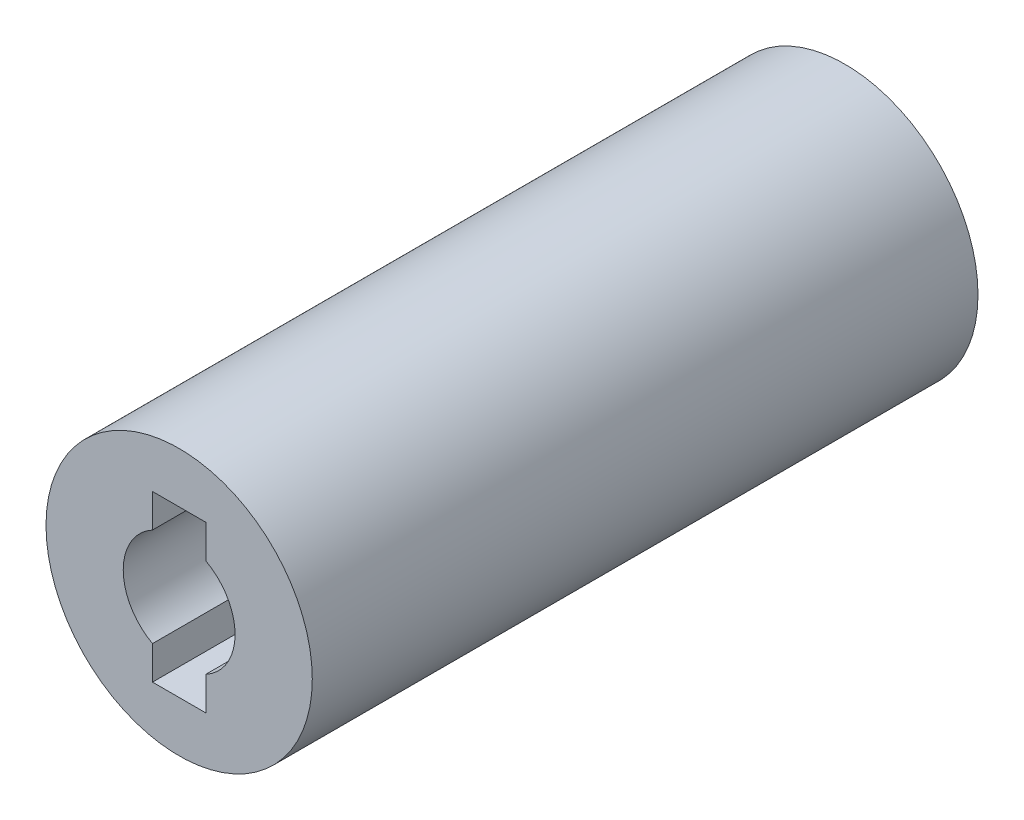
ISO-10303-21;
HEADER;
FILE_DESCRIPTION(('STEP AP214'),'2;1');
FILE_NAME('part.step','',(''),(''),'','','');
FILE_SCHEMA(('AUTOMOTIVE_DESIGN { 1 0 10303 214 1 1 1 1 }'));
ENDSEC;
DATA;
#1=APPLICATION_CONTEXT('core data for automotive mechanical design processes');
#2=APPLICATION_PROTOCOL_DEFINITION('international standard','automotive_design',2000,#1);
#3=PRODUCT_CONTEXT('',#1,'mechanical');
#4=PRODUCT('Part','Part','',(#3));
#5=PRODUCT_RELATED_PRODUCT_CATEGORY('part','',(#4));
#6=PRODUCT_DEFINITION_FORMATION('','',#4);
#7=PRODUCT_DEFINITION_CONTEXT('part definition',#1,'design');
#8=PRODUCT_DEFINITION('design','',#6,#7);
#9=PRODUCT_DEFINITION_SHAPE('','',#8);
#10=(LENGTH_UNIT() NAMED_UNIT(*) SI_UNIT(.MILLI.,.METRE.));
#11=(NAMED_UNIT(*) PLANE_ANGLE_UNIT() SI_UNIT($,.RADIAN.));
#12=(NAMED_UNIT(*) SI_UNIT($,.STERADIAN.) SOLID_ANGLE_UNIT());
#13=UNCERTAINTY_MEASURE_WITH_UNIT(LENGTH_MEASURE(1.E-05),#10,'distance_accuracy_value','');
#14=(GEOMETRIC_REPRESENTATION_CONTEXT(3) GLOBAL_UNCERTAINTY_ASSIGNED_CONTEXT((#13)) GLOBAL_UNIT_ASSIGNED_CONTEXT((#10,
#11,#12)) REPRESENTATION_CONTEXT('',''));
#15=CARTESIAN_POINT('',(0.,0.,0.));
#16=DIRECTION('',(0.,0.,1.));
#17=DIRECTION('',(1.,0.,0.));
#18=AXIS2_PLACEMENT_3D('',#15,#16,#17);
#19=CARTESIAN_POINT('',(0.,0.,15.));
#20=DIRECTION('',(0.,0.,1.));
#21=DIRECTION('',(1.,0.,0.));
#22=AXIS2_PLACEMENT_3D('',#19,#20,#21);
#23=CYLINDRICAL_SURFACE('',#22,2.1);
#24=CARTESIAN_POINT('',(0.,0.,25.));
#25=DIRECTION('',(0.,0.,1.));
#26=DIRECTION('',(1.,0.,0.));
#27=AXIS2_PLACEMENT_3D('',#24,#25,#26);
#28=CIRCLE('',#27,2.1);
#29=CARTESIAN_POINT('',(-1.,1.84661853126194,25.));
#30=VERTEX_POINT('',#29);
#31=CARTESIAN_POINT('',(-1.,-1.84661853126194,25.));
#32=VERTEX_POINT('',#31);
#33=EDGE_CURVE('E155',#30,#32,#28,.T.);
#34=ORIENTED_EDGE('',*,*,#33,.T.);
#35=DIRECTION('',(0.,0.,1.));
#36=VECTOR('',#35,1.);
#37=CARTESIAN_POINT('',(-1.,-1.84661853126194,15.));
#38=LINE('',#37,#36);
#39=CARTESIAN_POINT('',(-1.,-1.84661853126194,15.));
#40=VERTEX_POINT('',#39);
#41=EDGE_CURVE('E150',#32,#40,#38,.F.);
#42=ORIENTED_EDGE('',*,*,#41,.T.);
#43=CARTESIAN_POINT('',(0.,0.,15.));
#44=DIRECTION('',(0.,0.,1.));
#45=DIRECTION('',(1.,0.,0.));
#46=AXIS2_PLACEMENT_3D('',#43,#44,#45);
#47=CIRCLE('',#46,2.1);
#48=CARTESIAN_POINT('',(-1.,1.84661853126194,15.));
#49=VERTEX_POINT('',#48);
#50=EDGE_CURVE('E104',#49,#40,#47,.T.);
#51=ORIENTED_EDGE('',*,*,#50,.F.);
#52=DIRECTION('',(0.,0.,1.));
#53=VECTOR('',#52,1.);
#54=CARTESIAN_POINT('',(-1.,1.84661853126194,15.));
#55=LINE('',#54,#53);
#56=EDGE_CURVE('E147',#49,#30,#55,.T.);
#57=ORIENTED_EDGE('',*,*,#56,.T.);
#58=EDGE_LOOP('',(#34,#42,#51,#57));
#59=FACE_BOUND('',#58,.T.);
#60=ADVANCED_FACE('F33',(#59),#23,.F.);
#61=CARTESIAN_POINT('',(0.,0.,25.));
#62=DIRECTION('',(0.,0.,-1.));
#63=DIRECTION('',(-1.,0.,0.));
#64=AXIS2_PLACEMENT_3D('',#61,#62,#63);
#65=CYLINDRICAL_SURFACE('',#64,5.);
#66=CARTESIAN_POINT('',(0.,0.,25.));
#67=DIRECTION('',(0.,0.,1.));
#68=DIRECTION('',(1.,0.,0.));
#69=AXIS2_PLACEMENT_3D('',#66,#67,#68);
#70=CIRCLE('',#69,5.);
#71=CARTESIAN_POINT('',(5.,0.,25.));
#72=VERTEX_POINT('',#71);
#73=EDGE_CURVE('E11',#72,#72,#70,.T.);
#74=ORIENTED_EDGE('',*,*,#73,.F.);
#75=EDGE_LOOP('',(#74));
#76=FACE_BOUND('',#75,.T.);
#77=CARTESIAN_POINT('',(0.,0.,0.));
#78=DIRECTION('',(0.,0.,1.));
#79=DIRECTION('',(1.,0.,0.));
#80=AXIS2_PLACEMENT_3D('',#77,#78,#79);
#81=CIRCLE('',#80,5.);
#82=CARTESIAN_POINT('',(5.,0.,0.));
#83=VERTEX_POINT('',#82);
#84=EDGE_CURVE('E37',#83,#83,#81,.T.);
#85=ORIENTED_EDGE('',*,*,#84,.T.);
#86=EDGE_LOOP('',(#85));
#87=FACE_BOUND('',#86,.T.);
#88=ADVANCED_FACE('F35',(#76,#87),#65,.T.);
#89=CARTESIAN_POINT('',(0.,0.,25.));
#90=DIRECTION('',(0.,0.,1.));
#91=DIRECTION('',(1.,0.,0.));
#92=AXIS2_PLACEMENT_3D('',#89,#90,#91);
#93=PLANE('',#92);
#94=DIRECTION('',(0.,-1.,0.));
#95=VECTOR('',#94,1.);
#96=CARTESIAN_POINT('',(-1.,3.1,25.));
#97=LINE('',#96,#95);
#98=CARTESIAN_POINT('',(-1.,3.1,25.));
#99=VERTEX_POINT('',#98);
#100=EDGE_CURVE('E126',#99,#30,#97,.T.);
#101=ORIENTED_EDGE('',*,*,#100,.F.);
#102=DIRECTION('',(-1.,0.,0.));
#103=VECTOR('',#102,1.);
#104=CARTESIAN_POINT('',(-1.,3.1,25.));
#105=LINE('',#104,#103);
#106=CARTESIAN_POINT('',(1.,3.1,25.));
#107=VERTEX_POINT('',#106);
#108=EDGE_CURVE('E107',#107,#99,#105,.T.);
#109=ORIENTED_EDGE('',*,*,#108,.F.);
#110=DIRECTION('',(0.,1.,0.));
#111=VECTOR('',#110,1.);
#112=CARTESIAN_POINT('',(1.,3.1,25.));
#113=LINE('',#112,#111);
#114=CARTESIAN_POINT('',(1.,1.84661853126194,25.));
#115=VERTEX_POINT('',#114);
#116=EDGE_CURVE('E130',#115,#107,#113,.T.);
#117=ORIENTED_EDGE('',*,*,#116,.F.);
#118=CARTESIAN_POINT('',(1.,-1.84661853126194,25.));
#119=VERTEX_POINT('',#118);
#120=EDGE_CURVE('E152',#119,#115,#28,.T.);
#121=ORIENTED_EDGE('',*,*,#120,.F.);
#122=CARTESIAN_POINT('',(1.,-3.1,25.));
#123=VERTEX_POINT('',#122);
#124=EDGE_CURVE('E131',#123,#119,#113,.T.);
#125=ORIENTED_EDGE('',*,*,#124,.F.);
#126=DIRECTION('',(1.,0.,0.));
#127=VECTOR('',#126,1.);
#128=CARTESIAN_POINT('',(-1.,-3.1,25.));
#129=LINE('',#128,#127);
#130=CARTESIAN_POINT('',(-1.,-3.1,25.));
#131=VERTEX_POINT('',#130);
#132=EDGE_CURVE('E128',#131,#123,#129,.T.);
#133=ORIENTED_EDGE('',*,*,#132,.F.);
#134=EDGE_CURVE('E113',#32,#131,#97,.T.);
#135=ORIENTED_EDGE('',*,*,#134,.F.);
#136=ORIENTED_EDGE('',*,*,#33,.F.);
#137=EDGE_LOOP('',(#101,#109,#117,#121,#125,#133,#135,#136));
#138=FACE_BOUND('',#137,.T.);
#139=ORIENTED_EDGE('',*,*,#73,.T.);
#140=EDGE_LOOP('',(#139));
#141=FACE_BOUND('',#140,.T.);
#142=ADVANCED_FACE('F164',(#138,#141),#93,.T.);
#143=CARTESIAN_POINT('',(0.,0.,0.));
#144=DIRECTION('',(0.,0.,1.));
#145=DIRECTION('',(1.,0.,0.));
#146=AXIS2_PLACEMENT_3D('',#143,#144,#145);
#147=PLANE('',#146);
#148=ORIENTED_EDGE('',*,*,#84,.F.);
#149=EDGE_LOOP('',(#148));
#150=FACE_BOUND('',#149,.T.);
#151=ADVANCED_FACE('F185',(#150),#147,.F.);
#152=ORIENTED_EDGE('',*,*,#120,.T.);
#153=DIRECTION('',(0.,0.,1.));
#154=VECTOR('',#153,1.);
#155=CARTESIAN_POINT('',(1.,1.84661853126194,15.));
#156=LINE('',#155,#154);
#157=CARTESIAN_POINT('',(1.,1.84661853126194,15.));
#158=VERTEX_POINT('',#157);
#159=EDGE_CURVE('E144',#115,#158,#156,.F.);
#160=ORIENTED_EDGE('',*,*,#159,.T.);
#161=CARTESIAN_POINT('',(1.,-1.84661853126194,15.));
#162=VERTEX_POINT('',#161);
#163=EDGE_CURVE('E153',#162,#158,#47,.T.);
#164=ORIENTED_EDGE('',*,*,#163,.F.);
#165=DIRECTION('',(0.,0.,1.));
#166=VECTOR('',#165,1.);
#167=CARTESIAN_POINT('',(1.,-1.84661853126194,15.));
#168=LINE('',#167,#166);
#169=EDGE_CURVE('E137',#162,#119,#168,.T.);
#170=ORIENTED_EDGE('',*,*,#169,.T.);
#171=EDGE_LOOP('',(#152,#160,#164,#170));
#172=FACE_BOUND('',#171,.T.);
#173=ADVANCED_FACE('F172',(#172),#23,.F.);
#174=CARTESIAN_POINT('',(0.,0.,15.));
#175=DIRECTION('',(0.,0.,1.));
#176=DIRECTION('',(1.,0.,0.));
#177=AXIS2_PLACEMENT_3D('',#174,#175,#176);
#178=PLANE('',#177);
#179=ORIENTED_EDGE('',*,*,#163,.T.);
#180=DIRECTION('',(0.,1.,0.));
#181=VECTOR('',#180,1.);
#182=CARTESIAN_POINT('',(1.,3.1,15.));
#183=LINE('',#182,#181);
#184=CARTESIAN_POINT('',(1.,3.1,15.));
#185=VERTEX_POINT('',#184);
#186=EDGE_CURVE('E121',#158,#185,#183,.T.);
#187=ORIENTED_EDGE('',*,*,#186,.T.);
#188=DIRECTION('',(-1.,0.,0.));
#189=VECTOR('',#188,1.);
#190=CARTESIAN_POINT('',(-1.,3.1,15.));
#191=LINE('',#190,#189);
#192=CARTESIAN_POINT('',(-1.,3.1,15.));
#193=VERTEX_POINT('',#192);
#194=EDGE_CURVE('E118',#185,#193,#191,.T.);
#195=ORIENTED_EDGE('',*,*,#194,.T.);
#196=DIRECTION('',(0.,-1.,0.));
#197=VECTOR('',#196,1.);
#198=CARTESIAN_POINT('',(-1.,3.1,15.));
#199=LINE('',#198,#197);
#200=EDGE_CURVE('E55',#193,#49,#199,.T.);
#201=ORIENTED_EDGE('',*,*,#200,.T.);
#202=ORIENTED_EDGE('',*,*,#50,.T.);
#203=CARTESIAN_POINT('',(-1.,-3.1,15.));
#204=VERTEX_POINT('',#203);
#205=EDGE_CURVE('E98',#40,#204,#199,.T.);
#206=ORIENTED_EDGE('',*,*,#205,.T.);
#207=DIRECTION('',(1.,0.,0.));
#208=VECTOR('',#207,1.);
#209=CARTESIAN_POINT('',(-1.,-3.1,15.));
#210=LINE('',#209,#208);
#211=CARTESIAN_POINT('',(1.,-3.1,15.));
#212=VERTEX_POINT('',#211);
#213=EDGE_CURVE('E102',#204,#212,#210,.T.);
#214=ORIENTED_EDGE('',*,*,#213,.T.);
#215=EDGE_CURVE('E48',#212,#162,#183,.T.);
#216=ORIENTED_EDGE('',*,*,#215,.T.);
#217=EDGE_LOOP('',(#179,#187,#195,#201,#202,#206,#214,#216));
#218=FACE_BOUND('',#217,.T.);
#219=ADVANCED_FACE('F100',(#218),#178,.T.);
#220=CARTESIAN_POINT('',(1.,3.1,15.));
#221=DIRECTION('',(1.,0.,0.));
#222=DIRECTION('',(0.,0.,-1.));
#223=AXIS2_PLACEMENT_3D('',#220,#221,#222);
#224=PLANE('',#223);
#225=ORIENTED_EDGE('',*,*,#116,.T.);
#226=DIRECTION('',(0.,0.,1.));
#227=VECTOR('',#226,1.);
#228=CARTESIAN_POINT('',(1.,3.1,15.));
#229=LINE('',#228,#227);
#230=EDGE_CURVE('E138',#185,#107,#229,.T.);
#231=ORIENTED_EDGE('',*,*,#230,.F.);
#232=ORIENTED_EDGE('',*,*,#186,.F.);
#233=ORIENTED_EDGE('',*,*,#159,.F.);
#234=EDGE_LOOP('',(#225,#231,#232,#233));
#235=FACE_BOUND('',#234,.T.);
#236=ADVANCED_FACE('F176',(#235),#224,.F.);
#237=CARTESIAN_POINT('',(-1.,3.1,15.));
#238=DIRECTION('',(-1.,0.,0.));
#239=DIRECTION('',(0.,0.,1.));
#240=AXIS2_PLACEMENT_3D('',#237,#238,#239);
#241=PLANE('',#240);
#242=ORIENTED_EDGE('',*,*,#200,.F.);
#243=DIRECTION('',(0.,0.,1.));
#244=VECTOR('',#243,1.);
#245=CARTESIAN_POINT('',(-1.,3.1,15.));
#246=LINE('',#245,#244);
#247=EDGE_CURVE('E135',#193,#99,#246,.T.);
#248=ORIENTED_EDGE('',*,*,#247,.T.);
#249=ORIENTED_EDGE('',*,*,#100,.T.);
#250=ORIENTED_EDGE('',*,*,#56,.F.);
#251=EDGE_LOOP('',(#242,#248,#249,#250));
#252=FACE_BOUND('',#251,.T.);
#253=ADVANCED_FACE('F180',(#252),#241,.F.);
#254=CARTESIAN_POINT('',(-1.,3.1,15.));
#255=DIRECTION('',(0.,1.,0.));
#256=DIRECTION('',(0.,0.,1.));
#257=AXIS2_PLACEMENT_3D('',#254,#255,#256);
#258=PLANE('',#257);
#259=ORIENTED_EDGE('',*,*,#108,.T.);
#260=ORIENTED_EDGE('',*,*,#247,.F.);
#261=ORIENTED_EDGE('',*,*,#194,.F.);
#262=ORIENTED_EDGE('',*,*,#230,.T.);
#263=EDGE_LOOP('',(#259,#260,#261,#262));
#264=FACE_BOUND('',#263,.T.);
#265=ADVANCED_FACE('F178',(#264),#258,.F.);
#266=ORIENTED_EDGE('',*,*,#134,.T.);
#267=DIRECTION('',(0.,0.,1.));
#268=VECTOR('',#267,1.);
#269=CARTESIAN_POINT('',(-1.,-3.1,15.));
#270=LINE('',#269,#268);
#271=EDGE_CURVE('E110',#204,#131,#270,.T.);
#272=ORIENTED_EDGE('',*,*,#271,.F.);
#273=ORIENTED_EDGE('',*,*,#205,.F.);
#274=ORIENTED_EDGE('',*,*,#41,.F.);
#275=EDGE_LOOP('',(#266,#272,#273,#274));
#276=FACE_BOUND('',#275,.T.);
#277=ADVANCED_FACE('F111',(#276),#241,.F.);
#278=ORIENTED_EDGE('',*,*,#215,.F.);
#279=DIRECTION('',(0.,0.,1.));
#280=VECTOR('',#279,1.);
#281=CARTESIAN_POINT('',(1.,-3.1,15.));
#282=LINE('',#281,#280);
#283=EDGE_CURVE('E117',#212,#123,#282,.T.);
#284=ORIENTED_EDGE('',*,*,#283,.T.);
#285=ORIENTED_EDGE('',*,*,#124,.T.);
#286=ORIENTED_EDGE('',*,*,#169,.F.);
#287=EDGE_LOOP('',(#278,#284,#285,#286));
#288=FACE_BOUND('',#287,.T.);
#289=ADVANCED_FACE('F170',(#288),#224,.F.);
#290=CARTESIAN_POINT('',(-1.,-3.1,15.));
#291=DIRECTION('',(0.,-1.,0.));
#292=DIRECTION('',(0.,0.,-1.));
#293=AXIS2_PLACEMENT_3D('',#290,#291,#292);
#294=PLANE('',#293);
#295=ORIENTED_EDGE('',*,*,#132,.T.);
#296=ORIENTED_EDGE('',*,*,#283,.F.);
#297=ORIENTED_EDGE('',*,*,#213,.F.);
#298=ORIENTED_EDGE('',*,*,#271,.T.);
#299=EDGE_LOOP('',(#295,#296,#297,#298));
#300=FACE_BOUND('',#299,.T.);
#301=ADVANCED_FACE('F120',(#300),#294,.F.);
#302=CLOSED_SHELL('',(#60,#88,#142,#151,#173,#219,#236,#253,#265,#277,#289,#301));
#303=MANIFOLD_SOLID_BREP('B2',#302);
#304=ADVANCED_BREP_SHAPE_REPRESENTATION('',(#18,#303),#14);
#305=SHAPE_DEFINITION_REPRESENTATION(#9,#304);
ENDSEC;
END-ISO-10303-21;
